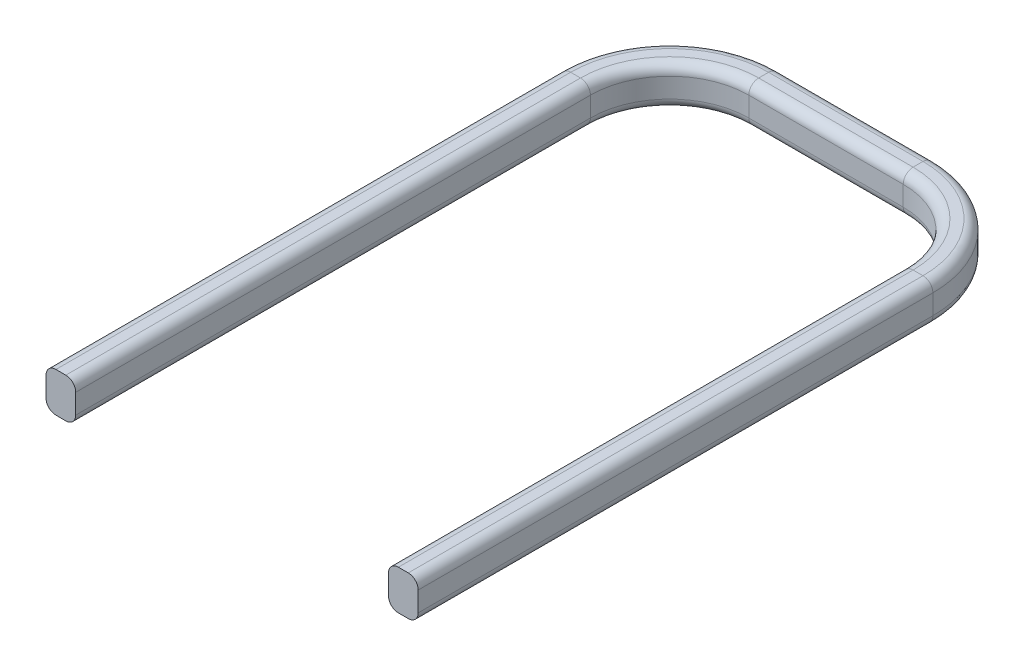
ISO-10303-21;
HEADER;
FILE_DESCRIPTION(('STEP AP214'),'2;1');
FILE_NAME('part.step','',(''),(''),'','','');
FILE_SCHEMA(('AUTOMOTIVE_DESIGN { 1 0 10303 214 1 1 1 1 }'));
ENDSEC;
DATA;
#1=APPLICATION_CONTEXT('core data for automotive mechanical design processes');
#2=APPLICATION_PROTOCOL_DEFINITION('international standard','automotive_design',2000,#1);
#3=PRODUCT_CONTEXT('',#1,'mechanical');
#4=PRODUCT('Part','Part','',(#3));
#5=PRODUCT_RELATED_PRODUCT_CATEGORY('part','',(#4));
#6=PRODUCT_DEFINITION_FORMATION('','',#4);
#7=PRODUCT_DEFINITION_CONTEXT('part definition',#1,'design');
#8=PRODUCT_DEFINITION('design','',#6,#7);
#9=PRODUCT_DEFINITION_SHAPE('','',#8);
#10=(LENGTH_UNIT() NAMED_UNIT(*) SI_UNIT(.MILLI.,.METRE.));
#11=(NAMED_UNIT(*) PLANE_ANGLE_UNIT() SI_UNIT($,.RADIAN.));
#12=(NAMED_UNIT(*) SI_UNIT($,.STERADIAN.) SOLID_ANGLE_UNIT());
#13=UNCERTAINTY_MEASURE_WITH_UNIT(LENGTH_MEASURE(1.E-05),#10,'distance_accuracy_value','');
#14=(GEOMETRIC_REPRESENTATION_CONTEXT(3) GLOBAL_UNCERTAINTY_ASSIGNED_CONTEXT((#13)) GLOBAL_UNIT_ASSIGNED_CONTEXT((#10,
#11,#12)) REPRESENTATION_CONTEXT('',''));
#15=CARTESIAN_POINT('',(0.,0.,0.));
#16=DIRECTION('',(0.,0.,1.));
#17=DIRECTION('',(1.,0.,0.));
#18=AXIS2_PLACEMENT_3D('',#15,#16,#17);
#19=CARTESIAN_POINT('',(0.,0.,0.));
#20=DIRECTION('',(0.,0.,-1.));
#21=DIRECTION('',(-1.,0.,0.));
#22=AXIS2_PLACEMENT_3D('',#19,#20,#21);
#23=PLANE('',#22);
#24=DIRECTION('',(0.,-1.,0.));
#25=VECTOR('',#24,1.);
#26=CARTESIAN_POINT('',(4.7,0.,0.));
#27=LINE('',#26,#25);
#28=CARTESIAN_POINT('',(4.7,0.75,0.));
#29=VERTEX_POINT('',#28);
#30=CARTESIAN_POINT('',(4.7,0.25,0.));
#31=VERTEX_POINT('',#30);
#32=EDGE_CURVE('E327',#29,#31,#27,.T.);
#33=ORIENTED_EDGE('',*,*,#32,.F.);
#34=CARTESIAN_POINT('',(4.45,0.75,0.));
#35=DIRECTION('',(0.,0.,-1.));
#36=DIRECTION('',(-1.,0.,0.));
#37=AXIS2_PLACEMENT_3D('',#34,#35,#36);
#38=CIRCLE('',#37,0.25);
#39=CARTESIAN_POINT('',(4.45,1.,0.));
#40=VERTEX_POINT('',#39);
#41=EDGE_CURVE('E209',#29,#40,#38,.F.);
#42=ORIENTED_EDGE('',*,*,#41,.T.);
#43=DIRECTION('',(1.,0.,0.));
#44=VECTOR('',#43,1.);
#45=CARTESIAN_POINT('',(3.95,1.,0.));
#46=LINE('',#45,#44);
#47=CARTESIAN_POINT('',(4.2,1.,0.));
#48=VERTEX_POINT('',#47);
#49=EDGE_CURVE('E323',#48,#40,#46,.T.);
#50=ORIENTED_EDGE('',*,*,#49,.F.);
#51=CARTESIAN_POINT('',(4.2,0.75,0.));
#52=DIRECTION('',(0.,0.,-1.));
#53=DIRECTION('',(-1.,0.,0.));
#54=AXIS2_PLACEMENT_3D('',#51,#52,#53);
#55=CIRCLE('',#54,0.25);
#56=CARTESIAN_POINT('',(3.95,0.75,0.));
#57=VERTEX_POINT('',#56);
#58=EDGE_CURVE('E229',#48,#57,#55,.F.);
#59=ORIENTED_EDGE('',*,*,#58,.T.);
#60=DIRECTION('',(0.,1.,0.));
#61=VECTOR('',#60,1.);
#62=CARTESIAN_POINT('',(3.95,0.,0.));
#63=LINE('',#62,#61);
#64=CARTESIAN_POINT('',(3.95,0.25,0.));
#65=VERTEX_POINT('',#64);
#66=EDGE_CURVE('E317',#65,#57,#63,.T.);
#67=ORIENTED_EDGE('',*,*,#66,.F.);
#68=CARTESIAN_POINT('',(4.2,0.25,0.));
#69=DIRECTION('',(0.,0.,-1.));
#70=DIRECTION('',(-1.,0.,0.));
#71=AXIS2_PLACEMENT_3D('',#68,#69,#70);
#72=CIRCLE('',#71,0.25);
#73=CARTESIAN_POINT('',(4.2,0.,0.));
#74=VERTEX_POINT('',#73);
#75=EDGE_CURVE('E391',#65,#74,#72,.F.);
#76=ORIENTED_EDGE('',*,*,#75,.T.);
#77=DIRECTION('',(-1.,0.,0.));
#78=VECTOR('',#77,1.);
#79=CARTESIAN_POINT('',(3.95,0.,0.));
#80=LINE('',#79,#78);
#81=CARTESIAN_POINT('',(4.45,0.,0.));
#82=VERTEX_POINT('',#81);
#83=EDGE_CURVE('E332',#82,#74,#80,.T.);
#84=ORIENTED_EDGE('',*,*,#83,.F.);
#85=CARTESIAN_POINT('',(4.45,0.25,0.));
#86=DIRECTION('',(0.,0.,-1.));
#87=DIRECTION('',(-1.,0.,0.));
#88=AXIS2_PLACEMENT_3D('',#85,#86,#87);
#89=CIRCLE('',#88,0.25);
#90=EDGE_CURVE('E393',#82,#31,#89,.F.);
#91=ORIENTED_EDGE('',*,*,#90,.T.);
#92=EDGE_LOOP('',(#33,#42,#50,#59,#67,#76,#84,#91));
#93=FACE_BOUND('',#92,.T.);
#94=ADVANCED_FACE('F33',(#93),#23,.F.);
#95=CARTESIAN_POINT('',(0.,0.,0.));
#96=DIRECTION('',(0.,0.,1.));
#97=DIRECTION('',(1.,0.,0.));
#98=AXIS2_PLACEMENT_3D('',#95,#96,#97);
#99=PLANE('',#98);
#100=DIRECTION('',(-1.,0.,0.));
#101=VECTOR('',#100,1.);
#102=CARTESIAN_POINT('',(-3.95,1.,0.));
#103=LINE('',#102,#101);
#104=CARTESIAN_POINT('',(-4.2,1.,0.));
#105=VERTEX_POINT('',#104);
#106=CARTESIAN_POINT('',(-4.45,1.,0.));
#107=VERTEX_POINT('',#106);
#108=EDGE_CURVE('E349',#105,#107,#103,.T.);
#109=ORIENTED_EDGE('',*,*,#108,.T.);
#110=CARTESIAN_POINT('',(-4.45,0.75,0.));
#111=DIRECTION('',(0.,0.,1.));
#112=DIRECTION('',(1.,0.,0.));
#113=AXIS2_PLACEMENT_3D('',#110,#111,#112);
#114=CIRCLE('',#113,0.25);
#115=CARTESIAN_POINT('',(-4.7,0.75,0.));
#116=VERTEX_POINT('',#115);
#117=EDGE_CURVE('E458',#107,#116,#114,.T.);
#118=ORIENTED_EDGE('',*,*,#117,.T.);
#119=DIRECTION('',(0.,-1.,0.));
#120=VECTOR('',#119,1.);
#121=CARTESIAN_POINT('',(-4.7,0.,0.));
#122=LINE('',#121,#120);
#123=CARTESIAN_POINT('',(-4.7,0.25,0.));
#124=VERTEX_POINT('',#123);
#125=EDGE_CURVE('E362',#116,#124,#122,.T.);
#126=ORIENTED_EDGE('',*,*,#125,.T.);
#127=CARTESIAN_POINT('',(-4.45,0.25,0.));
#128=DIRECTION('',(0.,0.,1.));
#129=DIRECTION('',(1.,0.,0.));
#130=AXIS2_PLACEMENT_3D('',#127,#128,#129);
#131=CIRCLE('',#130,0.25);
#132=CARTESIAN_POINT('',(-4.45,0.,0.));
#133=VERTEX_POINT('',#132);
#134=EDGE_CURVE('E57',#124,#133,#131,.T.);
#135=ORIENTED_EDGE('',*,*,#134,.T.);
#136=DIRECTION('',(1.,0.,0.));
#137=VECTOR('',#136,1.);
#138=CARTESIAN_POINT('',(-3.95,0.,0.));
#139=LINE('',#138,#137);
#140=CARTESIAN_POINT('',(-4.2,0.,0.));
#141=VERTEX_POINT('',#140);
#142=EDGE_CURVE('E230',#133,#141,#139,.T.);
#143=ORIENTED_EDGE('',*,*,#142,.T.);
#144=CARTESIAN_POINT('',(-4.2,0.25,0.));
#145=DIRECTION('',(0.,0.,1.));
#146=DIRECTION('',(1.,0.,0.));
#147=AXIS2_PLACEMENT_3D('',#144,#145,#146);
#148=CIRCLE('',#147,0.25);
#149=CARTESIAN_POINT('',(-3.95,0.25,0.));
#150=VERTEX_POINT('',#149);
#151=EDGE_CURVE('E455',#141,#150,#148,.T.);
#152=ORIENTED_EDGE('',*,*,#151,.T.);
#153=DIRECTION('',(0.,1.,0.));
#154=VECTOR('',#153,1.);
#155=CARTESIAN_POINT('',(-3.95,0.,0.));
#156=LINE('',#155,#154);
#157=CARTESIAN_POINT('',(-3.95,0.75,0.));
#158=VERTEX_POINT('',#157);
#159=EDGE_CURVE('E347',#150,#158,#156,.T.);
#160=ORIENTED_EDGE('',*,*,#159,.T.);
#161=CARTESIAN_POINT('',(-4.2,0.75,0.));
#162=DIRECTION('',(0.,0.,1.));
#163=DIRECTION('',(1.,0.,0.));
#164=AXIS2_PLACEMENT_3D('',#161,#162,#163);
#165=CIRCLE('',#164,0.25);
#166=EDGE_CURVE('E453',#158,#105,#165,.T.);
#167=ORIENTED_EDGE('',*,*,#166,.T.);
#168=EDGE_LOOP('',(#109,#118,#126,#135,#143,#152,#160,#167));
#169=FACE_BOUND('',#168,.T.);
#170=ADVANCED_FACE('F474',(#169),#99,.T.);
#171=CARTESIAN_POINT('',(3.95,0.,0.));
#172=DIRECTION('',(-1.,0.,0.));
#173=DIRECTION('',(0.,0.,1.));
#174=AXIS2_PLACEMENT_3D('',#171,#172,#173);
#175=PLANE('',#174);
#176=DIRECTION('',(0.,1.,0.));
#177=VECTOR('',#176,1.);
#178=CARTESIAN_POINT('',(3.95,0.,-13.));
#179=LINE('',#178,#177);
#180=CARTESIAN_POINT('',(3.95,0.25,-13.));
#181=VERTEX_POINT('',#180);
#182=CARTESIAN_POINT('',(3.95,0.75,-13.));
#183=VERTEX_POINT('',#182);
#184=EDGE_CURVE('E221',#181,#183,#179,.T.);
#185=ORIENTED_EDGE('',*,*,#184,.F.);
#186=DIRECTION('',(0.,0.,-1.));
#187=VECTOR('',#186,1.);
#188=CARTESIAN_POINT('',(3.95,0.25,0.));
#189=LINE('',#188,#187);
#190=EDGE_CURVE('E436',#181,#65,#189,.F.);
#191=ORIENTED_EDGE('',*,*,#190,.T.);
#192=ORIENTED_EDGE('',*,*,#66,.T.);
#193=DIRECTION('',(0.,0.,-1.));
#194=VECTOR('',#193,1.);
#195=CARTESIAN_POINT('',(3.95,0.75,0.));
#196=LINE('',#195,#194);
#197=EDGE_CURVE('E434',#57,#183,#196,.T.);
#198=ORIENTED_EDGE('',*,*,#197,.T.);
#199=EDGE_LOOP('',(#185,#191,#192,#198));
#200=FACE_BOUND('',#199,.T.);
#201=ADVANCED_FACE('F531',(#200),#175,.T.);
#202=CARTESIAN_POINT('',(3.95,1.,0.));
#203=DIRECTION('',(0.,1.,0.));
#204=DIRECTION('',(-1.,0.,0.));
#205=AXIS2_PLACEMENT_3D('',#202,#203,#204);
#206=PLANE('',#205);
#207=ORIENTED_EDGE('',*,*,#49,.T.);
#208=DIRECTION('',(0.,0.,-1.));
#209=VECTOR('',#208,1.);
#210=CARTESIAN_POINT('',(4.45,1.,0.));
#211=LINE('',#210,#209);
#212=CARTESIAN_POINT('',(4.45,1.,-13.));
#213=VERTEX_POINT('',#212);
#214=EDGE_CURVE('E219',#40,#213,#211,.T.);
#215=ORIENTED_EDGE('',*,*,#214,.T.);
#216=DIRECTION('',(1.,0.,0.));
#217=VECTOR('',#216,1.);
#218=CARTESIAN_POINT('',(3.95,1.,-13.));
#219=LINE('',#218,#217);
#220=CARTESIAN_POINT('',(4.2,1.,-13.));
#221=VERTEX_POINT('',#220);
#222=EDGE_CURVE('E201',#221,#213,#219,.T.);
#223=ORIENTED_EDGE('',*,*,#222,.F.);
#224=DIRECTION('',(0.,0.,-1.));
#225=VECTOR('',#224,1.);
#226=CARTESIAN_POINT('',(4.2,1.,0.));
#227=LINE('',#226,#225);
#228=EDGE_CURVE('E216',#221,#48,#227,.F.);
#229=ORIENTED_EDGE('',*,*,#228,.T.);
#230=EDGE_LOOP('',(#207,#215,#223,#229));
#231=FACE_BOUND('',#230,.T.);
#232=ADVANCED_FACE('F215',(#231),#206,.T.);
#233=CARTESIAN_POINT('',(4.7,0.,0.));
#234=DIRECTION('',(1.,0.,0.));
#235=DIRECTION('',(0.,0.,-1.));
#236=AXIS2_PLACEMENT_3D('',#233,#234,#235);
#237=PLANE('',#236);
#238=DIRECTION('',(0.,-1.,0.));
#239=VECTOR('',#238,1.);
#240=CARTESIAN_POINT('',(4.7,0.,-13.));
#241=LINE('',#240,#239);
#242=CARTESIAN_POINT('',(4.7,0.75,-13.));
#243=VERTEX_POINT('',#242);
#244=CARTESIAN_POINT('',(4.7,0.25,-13.));
#245=VERTEX_POINT('',#244);
#246=EDGE_CURVE('E220',#243,#245,#241,.T.);
#247=ORIENTED_EDGE('',*,*,#246,.F.);
#248=DIRECTION('',(0.,0.,-1.));
#249=VECTOR('',#248,1.);
#250=CARTESIAN_POINT('',(4.7,0.75,0.));
#251=LINE('',#250,#249);
#252=EDGE_CURVE('E388',#243,#29,#251,.F.);
#253=ORIENTED_EDGE('',*,*,#252,.T.);
#254=ORIENTED_EDGE('',*,*,#32,.T.);
#255=DIRECTION('',(0.,0.,-1.));
#256=VECTOR('',#255,1.);
#257=CARTESIAN_POINT('',(4.7,0.25,0.));
#258=LINE('',#257,#256);
#259=EDGE_CURVE('E385',#31,#245,#258,.T.);
#260=ORIENTED_EDGE('',*,*,#259,.T.);
#261=EDGE_LOOP('',(#247,#253,#254,#260));
#262=FACE_BOUND('',#261,.T.);
#263=ADVANCED_FACE('F501',(#262),#237,.T.);
#264=CARTESIAN_POINT('',(3.95,0.,0.));
#265=DIRECTION('',(0.,-1.,0.));
#266=DIRECTION('',(1.,0.,0.));
#267=AXIS2_PLACEMENT_3D('',#264,#265,#266);
#268=PLANE('',#267);
#269=DIRECTION('',(-1.,0.,0.));
#270=VECTOR('',#269,1.);
#271=CARTESIAN_POINT('',(3.95,0.,-13.));
#272=LINE('',#271,#270);
#273=CARTESIAN_POINT('',(4.45,0.,-13.));
#274=VERTEX_POINT('',#273);
#275=CARTESIAN_POINT('',(4.2,0.,-13.));
#276=VERTEX_POINT('',#275);
#277=EDGE_CURVE('E336',#274,#276,#272,.T.);
#278=ORIENTED_EDGE('',*,*,#277,.F.);
#279=DIRECTION('',(0.,0.,-1.));
#280=VECTOR('',#279,1.);
#281=CARTESIAN_POINT('',(4.45,0.,0.));
#282=LINE('',#281,#280);
#283=EDGE_CURVE('E420',#274,#82,#282,.F.);
#284=ORIENTED_EDGE('',*,*,#283,.T.);
#285=ORIENTED_EDGE('',*,*,#83,.T.);
#286=DIRECTION('',(0.,0.,-1.));
#287=VECTOR('',#286,1.);
#288=CARTESIAN_POINT('',(4.2,0.,0.));
#289=LINE('',#288,#287);
#290=EDGE_CURVE('E417',#74,#276,#289,.T.);
#291=ORIENTED_EDGE('',*,*,#290,.T.);
#292=EDGE_LOOP('',(#278,#284,#285,#291));
#293=FACE_BOUND('',#292,.T.);
#294=ADVANCED_FACE('F511',(#293),#268,.T.);
#295=CARTESIAN_POINT('',(1.95,0.,-13.));
#296=DIRECTION('',(0.,1.,0.));
#297=DIRECTION('',(0.,0.,1.));
#298=AXIS2_PLACEMENT_3D('',#295,#296,#297);
#299=CYLINDRICAL_SURFACE('',#298,2.);
#300=DIRECTION('',(0.,1.,0.));
#301=VECTOR('',#300,1.);
#302=CARTESIAN_POINT('',(1.95,0.,-15.));
#303=LINE('',#302,#301);
#304=CARTESIAN_POINT('',(1.95,0.25,-15.));
#305=VERTEX_POINT('',#304);
#306=CARTESIAN_POINT('',(1.95,0.75,-15.));
#307=VERTEX_POINT('',#306);
#308=EDGE_CURVE('E333',#305,#307,#303,.T.);
#309=ORIENTED_EDGE('',*,*,#308,.F.);
#310=CARTESIAN_POINT('',(1.95,0.25,-13.));
#311=DIRECTION('',(0.,-1.,0.));
#312=DIRECTION('',(0.,0.,-1.));
#313=AXIS2_PLACEMENT_3D('',#310,#311,#312);
#314=CIRCLE('',#313,2.);
#315=EDGE_CURVE('E439',#305,#181,#314,.T.);
#316=ORIENTED_EDGE('',*,*,#315,.T.);
#317=ORIENTED_EDGE('',*,*,#184,.T.);
#318=CARTESIAN_POINT('',(1.95,0.75,-13.));
#319=DIRECTION('',(0.,1.,0.));
#320=DIRECTION('',(0.,0.,1.));
#321=AXIS2_PLACEMENT_3D('',#318,#319,#320);
#322=CIRCLE('',#321,2.);
#323=EDGE_CURVE('E233',#183,#307,#322,.T.);
#324=ORIENTED_EDGE('',*,*,#323,.T.);
#325=EDGE_LOOP('',(#309,#316,#317,#324));
#326=FACE_BOUND('',#325,.T.);
#327=ADVANCED_FACE('F530',(#326),#299,.F.);
#328=CARTESIAN_POINT('',(3.95,1.,-13.));
#329=DIRECTION('',(0.,1.,0.));
#330=DIRECTION('',(0.,0.,1.));
#331=AXIS2_PLACEMENT_3D('',#328,#329,#330);
#332=PLANE('',#331);
#333=ORIENTED_EDGE('',*,*,#222,.T.);
#334=CARTESIAN_POINT('',(1.95,1.,-13.));
#335=DIRECTION('',(0.,1.,0.));
#336=DIRECTION('',(0.,0.,1.));
#337=AXIS2_PLACEMENT_3D('',#334,#335,#336);
#338=CIRCLE('',#337,2.5);
#339=CARTESIAN_POINT('',(1.95,1.,-15.5));
#340=VERTEX_POINT('',#339);
#341=EDGE_CURVE('E208',#213,#340,#338,.T.);
#342=ORIENTED_EDGE('',*,*,#341,.T.);
#343=DIRECTION('',(0.,0.,-1.));
#344=VECTOR('',#343,1.);
#345=CARTESIAN_POINT('',(1.95,1.,-15.));
#346=LINE('',#345,#344);
#347=CARTESIAN_POINT('',(1.95,1.,-15.25));
#348=VERTEX_POINT('',#347);
#349=EDGE_CURVE('E203',#348,#340,#346,.T.);
#350=ORIENTED_EDGE('',*,*,#349,.F.);
#351=CARTESIAN_POINT('',(1.95,1.,-13.));
#352=DIRECTION('',(0.,1.,0.));
#353=DIRECTION('',(0.,0.,1.));
#354=AXIS2_PLACEMENT_3D('',#351,#352,#353);
#355=CIRCLE('',#354,2.25);
#356=EDGE_CURVE('E198',#348,#221,#355,.F.);
#357=ORIENTED_EDGE('',*,*,#356,.T.);
#358=EDGE_LOOP('',(#333,#342,#350,#357));
#359=FACE_BOUND('',#358,.T.);
#360=ADVANCED_FACE('F200',(#359),#332,.T.);
#361=CARTESIAN_POINT('',(1.95,0.,-13.));
#362=DIRECTION('',(0.,1.,0.));
#363=DIRECTION('',(0.,0.,1.));
#364=AXIS2_PLACEMENT_3D('',#361,#362,#363);
#365=CYLINDRICAL_SURFACE('',#364,2.75);
#366=DIRECTION('',(0.,-1.,0.));
#367=VECTOR('',#366,1.);
#368=CARTESIAN_POINT('',(1.95,0.,-15.75));
#369=LINE('',#368,#367);
#370=CARTESIAN_POINT('',(1.95,0.75,-15.75));
#371=VERTEX_POINT('',#370);
#372=CARTESIAN_POINT('',(1.95,0.25,-15.75));
#373=VERTEX_POINT('',#372);
#374=EDGE_CURVE('E353',#371,#373,#369,.T.);
#375=ORIENTED_EDGE('',*,*,#374,.F.);
#376=CARTESIAN_POINT('',(1.95,0.75,-13.));
#377=DIRECTION('',(0.,1.,0.));
#378=DIRECTION('',(0.,0.,1.));
#379=AXIS2_PLACEMENT_3D('',#376,#377,#378);
#380=CIRCLE('',#379,2.75);
#381=EDGE_CURVE('E399',#371,#243,#380,.F.);
#382=ORIENTED_EDGE('',*,*,#381,.T.);
#383=ORIENTED_EDGE('',*,*,#246,.T.);
#384=CARTESIAN_POINT('',(1.95,0.25,-13.));
#385=DIRECTION('',(0.,-1.,0.));
#386=DIRECTION('',(0.,0.,-1.));
#387=AXIS2_PLACEMENT_3D('',#384,#385,#386);
#388=CIRCLE('',#387,2.75);
#389=EDGE_CURVE('E397',#245,#373,#388,.F.);
#390=ORIENTED_EDGE('',*,*,#389,.T.);
#391=EDGE_LOOP('',(#375,#382,#383,#390));
#392=FACE_BOUND('',#391,.T.);
#393=ADVANCED_FACE('F494',(#392),#365,.T.);
#394=CARTESIAN_POINT('',(3.95,0.,-13.));
#395=DIRECTION('',(0.,-1.,0.));
#396=DIRECTION('',(0.,0.,-1.));
#397=AXIS2_PLACEMENT_3D('',#394,#395,#396);
#398=PLANE('',#397);
#399=DIRECTION('',(0.,0.,1.));
#400=VECTOR('',#399,1.);
#401=CARTESIAN_POINT('',(1.95,0.,-15.));
#402=LINE('',#401,#400);
#403=CARTESIAN_POINT('',(1.95,0.,-15.5));
#404=VERTEX_POINT('',#403);
#405=CARTESIAN_POINT('',(1.95,0.,-15.25));
#406=VERTEX_POINT('',#405);
#407=EDGE_CURVE('E341',#404,#406,#402,.T.);
#408=ORIENTED_EDGE('',*,*,#407,.F.);
#409=CARTESIAN_POINT('',(1.95,0.,-13.));
#410=DIRECTION('',(0.,-1.,0.));
#411=DIRECTION('',(0.,0.,-1.));
#412=AXIS2_PLACEMENT_3D('',#409,#410,#411);
#413=CIRCLE('',#412,2.5);
#414=EDGE_CURVE('E424',#404,#274,#413,.T.);
#415=ORIENTED_EDGE('',*,*,#414,.T.);
#416=ORIENTED_EDGE('',*,*,#277,.T.);
#417=CARTESIAN_POINT('',(1.95,0.,-13.));
#418=DIRECTION('',(0.,-1.,0.));
#419=DIRECTION('',(0.,0.,-1.));
#420=AXIS2_PLACEMENT_3D('',#417,#418,#419);
#421=CIRCLE('',#420,2.25);
#422=EDGE_CURVE('E422',#276,#406,#421,.F.);
#423=ORIENTED_EDGE('',*,*,#422,.T.);
#424=EDGE_LOOP('',(#408,#415,#416,#423));
#425=FACE_BOUND('',#424,.T.);
#426=ADVANCED_FACE('F520',(#425),#398,.T.);
#427=CARTESIAN_POINT('',(1.94999999999999,0.,-15.));
#428=DIRECTION('',(0.,0.,1.));
#429=DIRECTION('',(1.,0.,0.));
#430=AXIS2_PLACEMENT_3D('',#427,#428,#429);
#431=PLANE('',#430);
#432=DIRECTION('',(0.,1.,0.));
#433=VECTOR('',#432,1.);
#434=CARTESIAN_POINT('',(-1.94999999999999,0.,-15.));
#435=LINE('',#434,#433);
#436=CARTESIAN_POINT('',(-1.94999999999999,0.25,-15.));
#437=VERTEX_POINT('',#436);
#438=CARTESIAN_POINT('',(-1.94999999999999,0.75,-15.));
#439=VERTEX_POINT('',#438);
#440=EDGE_CURVE('E337',#437,#439,#435,.T.);
#441=ORIENTED_EDGE('',*,*,#440,.F.);
#442=DIRECTION('',(-1.,0.,0.));
#443=VECTOR('',#442,1.);
#444=CARTESIAN_POINT('',(1.94999999999999,0.25,-15.));
#445=LINE('',#444,#443);
#446=EDGE_CURVE('E443',#437,#305,#445,.F.);
#447=ORIENTED_EDGE('',*,*,#446,.T.);
#448=ORIENTED_EDGE('',*,*,#308,.T.);
#449=DIRECTION('',(-1.,0.,0.));
#450=VECTOR('',#449,1.);
#451=CARTESIAN_POINT('',(1.94999999999999,0.75,-15.));
#452=LINE('',#451,#450);
#453=EDGE_CURVE('E441',#307,#439,#452,.T.);
#454=ORIENTED_EDGE('',*,*,#453,.T.);
#455=EDGE_LOOP('',(#441,#447,#448,#454));
#456=FACE_BOUND('',#455,.T.);
#457=ADVANCED_FACE('F528',(#456),#431,.T.);
#458=CARTESIAN_POINT('',(1.94999999999999,1.,-15.));
#459=DIRECTION('',(0.,1.,0.));
#460=DIRECTION('',(0.,0.,1.));
#461=AXIS2_PLACEMENT_3D('',#458,#459,#460);
#462=PLANE('',#461);
#463=ORIENTED_EDGE('',*,*,#349,.T.);
#464=DIRECTION('',(-1.,0.,0.));
#465=VECTOR('',#464,1.);
#466=CARTESIAN_POINT('',(1.94999999999999,1.,-15.5));
#467=LINE('',#466,#465);
#468=CARTESIAN_POINT('',(-1.94999999999999,1.,-15.5));
#469=VERTEX_POINT('',#468);
#470=EDGE_CURVE('E403',#340,#469,#467,.T.);
#471=ORIENTED_EDGE('',*,*,#470,.T.);
#472=DIRECTION('',(0.,0.,-1.));
#473=VECTOR('',#472,1.);
#474=CARTESIAN_POINT('',(-1.94999999999999,1.,-15.));
#475=LINE('',#474,#473);
#476=CARTESIAN_POINT('',(-1.94999999999999,1.,-15.25));
#477=VERTEX_POINT('',#476);
#478=EDGE_CURVE('E340',#477,#469,#475,.T.);
#479=ORIENTED_EDGE('',*,*,#478,.F.);
#480=DIRECTION('',(-1.,0.,0.));
#481=VECTOR('',#480,1.);
#482=CARTESIAN_POINT('',(1.94999999999999,1.,-15.25));
#483=LINE('',#482,#481);
#484=EDGE_CURVE('E401',#477,#348,#483,.F.);
#485=ORIENTED_EDGE('',*,*,#484,.T.);
#486=EDGE_LOOP('',(#463,#471,#479,#485));
#487=FACE_BOUND('',#486,.T.);
#488=ADVANCED_FACE('F749',(#487),#462,.T.);
#489=CARTESIAN_POINT('',(1.94999999999999,0.,-15.75));
#490=DIRECTION('',(0.,0.,-1.));
#491=DIRECTION('',(-1.,0.,0.));
#492=AXIS2_PLACEMENT_3D('',#489,#490,#491);
#493=PLANE('',#492);
#494=DIRECTION('',(0.,-1.,0.));
#495=VECTOR('',#494,1.);
#496=CARTESIAN_POINT('',(-1.94999999999999,0.,-15.75));
#497=LINE('',#496,#495);
#498=CARTESIAN_POINT('',(-1.94999999999999,0.75,-15.75));
#499=VERTEX_POINT('',#498);
#500=CARTESIAN_POINT('',(-1.94999999999999,0.25,-15.75));
#501=VERTEX_POINT('',#500);
#502=EDGE_CURVE('E356',#499,#501,#497,.T.);
#503=ORIENTED_EDGE('',*,*,#502,.F.);
#504=DIRECTION('',(-1.,0.,0.));
#505=VECTOR('',#504,1.);
#506=CARTESIAN_POINT('',(1.94999999999999,0.75,-15.75));
#507=LINE('',#506,#505);
#508=EDGE_CURVE('E407',#499,#371,#507,.F.);
#509=ORIENTED_EDGE('',*,*,#508,.T.);
#510=ORIENTED_EDGE('',*,*,#374,.T.);
#511=DIRECTION('',(-1.,0.,0.));
#512=VECTOR('',#511,1.);
#513=CARTESIAN_POINT('',(1.94999999999999,0.25,-15.75));
#514=LINE('',#513,#512);
#515=EDGE_CURVE('E405',#373,#501,#514,.T.);
#516=ORIENTED_EDGE('',*,*,#515,.T.);
#517=EDGE_LOOP('',(#503,#509,#510,#516));
#518=FACE_BOUND('',#517,.T.);
#519=ADVANCED_FACE('F492',(#518),#493,.T.);
#520=CARTESIAN_POINT('',(1.94999999999999,0.,-15.));
#521=DIRECTION('',(0.,-1.,0.));
#522=DIRECTION('',(0.,0.,-1.));
#523=AXIS2_PLACEMENT_3D('',#520,#521,#522);
#524=PLANE('',#523);
#525=DIRECTION('',(0.,0.,1.));
#526=VECTOR('',#525,1.);
#527=CARTESIAN_POINT('',(-1.94999999999999,0.,-15.));
#528=LINE('',#527,#526);
#529=CARTESIAN_POINT('',(-1.94999999999999,0.,-15.5));
#530=VERTEX_POINT('',#529);
#531=CARTESIAN_POINT('',(-1.94999999999999,0.,-15.25));
#532=VERTEX_POINT('',#531);
#533=EDGE_CURVE('E346',#530,#532,#528,.T.);
#534=ORIENTED_EDGE('',*,*,#533,.F.);
#535=DIRECTION('',(-1.,0.,0.));
#536=VECTOR('',#535,1.);
#537=CARTESIAN_POINT('',(1.94999999999999,0.,-15.5));
#538=LINE('',#537,#536);
#539=EDGE_CURVE('E428',#530,#404,#538,.F.);
#540=ORIENTED_EDGE('',*,*,#539,.T.);
#541=ORIENTED_EDGE('',*,*,#407,.T.);
#542=DIRECTION('',(-1.,0.,0.));
#543=VECTOR('',#542,1.);
#544=CARTESIAN_POINT('',(1.94999999999999,0.,-15.25));
#545=LINE('',#544,#543);
#546=EDGE_CURVE('E426',#406,#532,#545,.T.);
#547=ORIENTED_EDGE('',*,*,#546,.T.);
#548=EDGE_LOOP('',(#534,#540,#541,#547));
#549=FACE_BOUND('',#548,.T.);
#550=ADVANCED_FACE('F523',(#549),#524,.T.);
#551=CARTESIAN_POINT('',(-1.95,0.,-13.));
#552=DIRECTION('',(0.,1.,0.));
#553=DIRECTION('',(0.,0.,1.));
#554=AXIS2_PLACEMENT_3D('',#551,#552,#553);
#555=CYLINDRICAL_SURFACE('',#554,2.);
#556=DIRECTION('',(0.,1.,0.));
#557=VECTOR('',#556,1.);
#558=CARTESIAN_POINT('',(-3.95,0.,-13.));
#559=LINE('',#558,#557);
#560=CARTESIAN_POINT('',(-3.95,0.25,-13.));
#561=VERTEX_POINT('',#560);
#562=CARTESIAN_POINT('',(-3.95,0.75,-13.));
#563=VERTEX_POINT('',#562);
#564=EDGE_CURVE('E342',#561,#563,#559,.T.);
#565=ORIENTED_EDGE('',*,*,#564,.F.);
#566=CARTESIAN_POINT('',(-1.95,0.25,-13.));
#567=DIRECTION('',(0.,-1.,0.));
#568=DIRECTION('',(0.,0.,-1.));
#569=AXIS2_PLACEMENT_3D('',#566,#567,#568);
#570=CIRCLE('',#569,2.);
#571=EDGE_CURVE('E447',#561,#437,#570,.T.);
#572=ORIENTED_EDGE('',*,*,#571,.T.);
#573=ORIENTED_EDGE('',*,*,#440,.T.);
#574=CARTESIAN_POINT('',(-1.95,0.75,-13.));
#575=DIRECTION('',(0.,1.,0.));
#576=DIRECTION('',(0.,0.,1.));
#577=AXIS2_PLACEMENT_3D('',#574,#575,#576);
#578=CIRCLE('',#577,2.);
#579=EDGE_CURVE('E445',#439,#563,#578,.T.);
#580=ORIENTED_EDGE('',*,*,#579,.T.);
#581=EDGE_LOOP('',(#565,#572,#573,#580));
#582=FACE_BOUND('',#581,.T.);
#583=ADVANCED_FACE('F724',(#582),#555,.F.);
#584=CARTESIAN_POINT('',(-1.94999999999999,1.,-15.));
#585=DIRECTION('',(0.,1.,0.));
#586=DIRECTION('',(0.,0.,1.));
#587=AXIS2_PLACEMENT_3D('',#584,#585,#586);
#588=PLANE('',#587);
#589=ORIENTED_EDGE('',*,*,#478,.T.);
#590=CARTESIAN_POINT('',(-1.95,1.,-13.));
#591=DIRECTION('',(0.,1.,0.));
#592=DIRECTION('',(0.,0.,1.));
#593=AXIS2_PLACEMENT_3D('',#590,#591,#592);
#594=CIRCLE('',#593,2.5);
#595=CARTESIAN_POINT('',(-4.45,1.,-13.));
#596=VERTEX_POINT('',#595);
#597=EDGE_CURVE('E411',#469,#596,#594,.T.);
#598=ORIENTED_EDGE('',*,*,#597,.T.);
#599=DIRECTION('',(-1.,0.,0.));
#600=VECTOR('',#599,1.);
#601=CARTESIAN_POINT('',(-3.95,1.,-13.));
#602=LINE('',#601,#600);
#603=CARTESIAN_POINT('',(-4.2,1.,-13.));
#604=VERTEX_POINT('',#603);
#605=EDGE_CURVE('E345',#604,#596,#602,.T.);
#606=ORIENTED_EDGE('',*,*,#605,.F.);
#607=CARTESIAN_POINT('',(-1.95,1.,-13.));
#608=DIRECTION('',(0.,1.,0.));
#609=DIRECTION('',(0.,0.,1.));
#610=AXIS2_PLACEMENT_3D('',#607,#608,#609);
#611=CIRCLE('',#610,2.25);
#612=EDGE_CURVE('E409',#604,#477,#611,.F.);
#613=ORIENTED_EDGE('',*,*,#612,.T.);
#614=EDGE_LOOP('',(#589,#598,#606,#613));
#615=FACE_BOUND('',#614,.T.);
#616=ADVANCED_FACE('F483',(#615),#588,.T.);
#617=CARTESIAN_POINT('',(-1.95,0.,-13.));
#618=DIRECTION('',(0.,1.,0.));
#619=DIRECTION('',(0.,0.,1.));
#620=AXIS2_PLACEMENT_3D('',#617,#618,#619);
#621=CYLINDRICAL_SURFACE('',#620,2.75);
#622=DIRECTION('',(0.,-1.,0.));
#623=VECTOR('',#622,1.);
#624=CARTESIAN_POINT('',(-4.7,0.,-13.));
#625=LINE('',#624,#623);
#626=CARTESIAN_POINT('',(-4.7,0.75,-13.));
#627=VERTEX_POINT('',#626);
#628=CARTESIAN_POINT('',(-4.7,0.25,-13.));
#629=VERTEX_POINT('',#628);
#630=EDGE_CURVE('E359',#627,#629,#625,.T.);
#631=ORIENTED_EDGE('',*,*,#630,.F.);
#632=CARTESIAN_POINT('',(-1.95,0.75,-13.));
#633=DIRECTION('',(0.,1.,0.));
#634=DIRECTION('',(0.,0.,1.));
#635=AXIS2_PLACEMENT_3D('',#632,#633,#634);
#636=CIRCLE('',#635,2.75);
#637=EDGE_CURVE('E415',#627,#499,#636,.F.);
#638=ORIENTED_EDGE('',*,*,#637,.T.);
#639=ORIENTED_EDGE('',*,*,#502,.T.);
#640=CARTESIAN_POINT('',(-1.95,0.25,-13.));
#641=DIRECTION('',(0.,-1.,0.));
#642=DIRECTION('',(0.,0.,-1.));
#643=AXIS2_PLACEMENT_3D('',#640,#641,#642);
#644=CIRCLE('',#643,2.75);
#645=EDGE_CURVE('E413',#501,#629,#644,.F.);
#646=ORIENTED_EDGE('',*,*,#645,.T.);
#647=EDGE_LOOP('',(#631,#638,#639,#646));
#648=FACE_BOUND('',#647,.T.);
#649=ADVANCED_FACE('F706',(#648),#621,.T.);
#650=CARTESIAN_POINT('',(-1.94999999999999,0.,-15.));
#651=DIRECTION('',(0.,-1.,0.));
#652=DIRECTION('',(0.,0.,-1.));
#653=AXIS2_PLACEMENT_3D('',#650,#651,#652);
#654=PLANE('',#653);
#655=DIRECTION('',(1.,0.,0.));
#656=VECTOR('',#655,1.);
#657=CARTESIAN_POINT('',(-3.95,0.,-13.));
#658=LINE('',#657,#656);
#659=CARTESIAN_POINT('',(-4.45,0.,-13.));
#660=VERTEX_POINT('',#659);
#661=CARTESIAN_POINT('',(-4.2,0.,-13.));
#662=VERTEX_POINT('',#661);
#663=EDGE_CURVE('E350',#660,#662,#658,.T.);
#664=ORIENTED_EDGE('',*,*,#663,.F.);
#665=CARTESIAN_POINT('',(-1.95,0.,-13.));
#666=DIRECTION('',(0.,-1.,0.));
#667=DIRECTION('',(0.,0.,-1.));
#668=AXIS2_PLACEMENT_3D('',#665,#666,#667);
#669=CIRCLE('',#668,2.5);
#670=EDGE_CURVE('E432',#660,#530,#669,.T.);
#671=ORIENTED_EDGE('',*,*,#670,.T.);
#672=ORIENTED_EDGE('',*,*,#533,.T.);
#673=CARTESIAN_POINT('',(-1.95,0.,-13.));
#674=DIRECTION('',(0.,-1.,0.));
#675=DIRECTION('',(0.,0.,-1.));
#676=AXIS2_PLACEMENT_3D('',#673,#674,#675);
#677=CIRCLE('',#676,2.25);
#678=EDGE_CURVE('E430',#532,#662,#677,.F.);
#679=ORIENTED_EDGE('',*,*,#678,.T.);
#680=EDGE_LOOP('',(#664,#671,#672,#679));
#681=FACE_BOUND('',#680,.T.);
#682=ADVANCED_FACE('F555',(#681),#654,.T.);
#683=CARTESIAN_POINT('',(-3.95,0.,-13.));
#684=DIRECTION('',(1.,0.,0.));
#685=DIRECTION('',(0.,0.,-1.));
#686=AXIS2_PLACEMENT_3D('',#683,#684,#685);
#687=PLANE('',#686);
#688=ORIENTED_EDGE('',*,*,#159,.F.);
#689=DIRECTION('',(0.,0.,1.));
#690=VECTOR('',#689,1.);
#691=CARTESIAN_POINT('',(-3.95,0.25,-13.));
#692=LINE('',#691,#690);
#693=EDGE_CURVE('E11',#150,#561,#692,.F.);
#694=ORIENTED_EDGE('',*,*,#693,.T.);
#695=ORIENTED_EDGE('',*,*,#564,.T.);
#696=DIRECTION('',(0.,0.,1.));
#697=VECTOR('',#696,1.);
#698=CARTESIAN_POINT('',(-3.95,0.75,-13.));
#699=LINE('',#698,#697);
#700=EDGE_CURVE('E42',#563,#158,#699,.T.);
#701=ORIENTED_EDGE('',*,*,#700,.T.);
#702=EDGE_LOOP('',(#688,#694,#695,#701));
#703=FACE_BOUND('',#702,.T.);
#704=ADVANCED_FACE('F469',(#703),#687,.T.);
#705=CARTESIAN_POINT('',(-3.95,1.,-13.));
#706=DIRECTION('',(0.,1.,0.));
#707=DIRECTION('',(-1.,0.,0.));
#708=AXIS2_PLACEMENT_3D('',#705,#706,#707);
#709=PLANE('',#708);
#710=ORIENTED_EDGE('',*,*,#605,.T.);
#711=DIRECTION('',(0.,0.,1.));
#712=VECTOR('',#711,1.);
#713=CARTESIAN_POINT('',(-4.45,1.,-13.));
#714=LINE('',#713,#712);
#715=EDGE_CURVE('E451',#596,#107,#714,.T.);
#716=ORIENTED_EDGE('',*,*,#715,.T.);
#717=ORIENTED_EDGE('',*,*,#108,.F.);
#718=DIRECTION('',(0.,0.,1.));
#719=VECTOR('',#718,1.);
#720=CARTESIAN_POINT('',(-4.2,1.,-13.));
#721=LINE('',#720,#719);
#722=EDGE_CURVE('E449',#105,#604,#721,.F.);
#723=ORIENTED_EDGE('',*,*,#722,.T.);
#724=EDGE_LOOP('',(#710,#716,#717,#723));
#725=FACE_BOUND('',#724,.T.);
#726=ADVANCED_FACE('F480',(#725),#709,.T.);
#727=CARTESIAN_POINT('',(-4.7,0.,-13.));
#728=DIRECTION('',(-1.,0.,0.));
#729=DIRECTION('',(0.,0.,1.));
#730=AXIS2_PLACEMENT_3D('',#727,#728,#729);
#731=PLANE('',#730);
#732=ORIENTED_EDGE('',*,*,#125,.F.);
#733=DIRECTION('',(0.,0.,1.));
#734=VECTOR('',#733,1.);
#735=CARTESIAN_POINT('',(-4.7,0.75,-13.));
#736=LINE('',#735,#734);
#737=EDGE_CURVE('E462',#116,#627,#736,.F.);
#738=ORIENTED_EDGE('',*,*,#737,.T.);
#739=ORIENTED_EDGE('',*,*,#630,.T.);
#740=DIRECTION('',(0.,0.,1.));
#741=VECTOR('',#740,1.);
#742=CARTESIAN_POINT('',(-4.7,0.25,-13.));
#743=LINE('',#742,#741);
#744=EDGE_CURVE('E460',#629,#124,#743,.T.);
#745=ORIENTED_EDGE('',*,*,#744,.T.);
#746=EDGE_LOOP('',(#732,#738,#739,#745));
#747=FACE_BOUND('',#746,.T.);
#748=ADVANCED_FACE('F544',(#747),#731,.T.);
#749=CARTESIAN_POINT('',(-3.95,0.,-13.));
#750=DIRECTION('',(0.,-1.,0.));
#751=DIRECTION('',(1.,0.,0.));
#752=AXIS2_PLACEMENT_3D('',#749,#750,#751);
#753=PLANE('',#752);
#754=ORIENTED_EDGE('',*,*,#142,.F.);
#755=DIRECTION('',(0.,0.,1.));
#756=VECTOR('',#755,1.);
#757=CARTESIAN_POINT('',(-4.45,0.,-13.));
#758=LINE('',#757,#756);
#759=EDGE_CURVE('E465',#133,#660,#758,.F.);
#760=ORIENTED_EDGE('',*,*,#759,.T.);
#761=ORIENTED_EDGE('',*,*,#663,.T.);
#762=DIRECTION('',(0.,0.,1.));
#763=VECTOR('',#762,1.);
#764=CARTESIAN_POINT('',(-4.2,0.,-13.));
#765=LINE('',#764,#763);
#766=EDGE_CURVE('E50',#662,#141,#765,.T.);
#767=ORIENTED_EDGE('',*,*,#766,.T.);
#768=EDGE_LOOP('',(#754,#760,#761,#767));
#769=FACE_BOUND('',#768,.T.);
#770=ADVANCED_FACE('F541',(#769),#753,.T.);
#771=CARTESIAN_POINT('',(-4.45,0.75,-13.));
#772=DIRECTION('',(0.,0.,1.));
#773=DIRECTION('',(1.,0.,0.));
#774=AXIS2_PLACEMENT_3D('',#771,#772,#773);
#775=CYLINDRICAL_SURFACE('',#774,0.25);
#776=ORIENTED_EDGE('',*,*,#117,.F.);
#777=ORIENTED_EDGE('',*,*,#715,.F.);
#778=CARTESIAN_POINT('',(-4.45,0.75,-13.));
#779=DIRECTION('',(0.,0.,-1.));
#780=DIRECTION('',(-1.,0.,0.));
#781=AXIS2_PLACEMENT_3D('',#778,#779,#780);
#782=CIRCLE('',#781,0.25);
#783=EDGE_CURVE('E288',#627,#596,#782,.T.);
#784=ORIENTED_EDGE('',*,*,#783,.F.);
#785=ORIENTED_EDGE('',*,*,#737,.F.);
#786=EDGE_LOOP('',(#776,#777,#784,#785));
#787=FACE_BOUND('',#786,.T.);
#788=ADVANCED_FACE('F543',(#787),#775,.T.);
#789=CARTESIAN_POINT('',(-1.95,0.75,-13.));
#790=DIRECTION('',(0.,1.,0.));
#791=DIRECTION('',(0.,0.,1.));
#792=AXIS2_PLACEMENT_3D('',#789,#790,#791);
#793=TOROIDAL_SURFACE('',#792,2.5,0.25);
#794=ORIENTED_EDGE('',*,*,#783,.T.);
#795=ORIENTED_EDGE('',*,*,#597,.F.);
#796=CARTESIAN_POINT('',(-1.94999999999999,0.75,-15.5));
#797=DIRECTION('',(1.,0.,0.));
#798=DIRECTION('',(0.,1.,0.));
#799=AXIS2_PLACEMENT_3D('',#796,#797,#798);
#800=CIRCLE('',#799,0.25);
#801=EDGE_CURVE('E308',#499,#469,#800,.T.);
#802=ORIENTED_EDGE('',*,*,#801,.F.);
#803=ORIENTED_EDGE('',*,*,#637,.F.);
#804=EDGE_LOOP('',(#794,#795,#802,#803));
#805=FACE_BOUND('',#804,.T.);
#806=ADVANCED_FACE('F485',(#805),#793,.T.);
#807=CARTESIAN_POINT('',(1.94999999999999,0.75,-15.5));
#808=DIRECTION('',(-1.,0.,0.));
#809=DIRECTION('',(0.,0.,1.));
#810=AXIS2_PLACEMENT_3D('',#807,#808,#809);
#811=CYLINDRICAL_SURFACE('',#810,0.25);
#812=ORIENTED_EDGE('',*,*,#801,.T.);
#813=ORIENTED_EDGE('',*,*,#470,.F.);
#814=CARTESIAN_POINT('',(1.95,0.75,-15.5));
#815=DIRECTION('',(1.,0.,0.));
#816=DIRECTION('',(0.,0.,-1.));
#817=AXIS2_PLACEMENT_3D('',#814,#815,#816);
#818=CIRCLE('',#817,0.25);
#819=EDGE_CURVE('E301',#371,#340,#818,.T.);
#820=ORIENTED_EDGE('',*,*,#819,.F.);
#821=ORIENTED_EDGE('',*,*,#508,.F.);
#822=EDGE_LOOP('',(#812,#813,#820,#821));
#823=FACE_BOUND('',#822,.T.);
#824=ADVANCED_FACE('F487',(#823),#811,.T.);
#825=CARTESIAN_POINT('',(1.95,0.75,-13.));
#826=DIRECTION('',(0.,1.,0.));
#827=DIRECTION('',(0.,0.,1.));
#828=AXIS2_PLACEMENT_3D('',#825,#826,#827);
#829=TOROIDAL_SURFACE('',#828,2.5,0.25);
#830=ORIENTED_EDGE('',*,*,#819,.T.);
#831=ORIENTED_EDGE('',*,*,#341,.F.);
#832=CARTESIAN_POINT('',(4.45,0.75,-13.));
#833=DIRECTION('',(0.,0.,1.));
#834=DIRECTION('',(0.,-1.,0.));
#835=AXIS2_PLACEMENT_3D('',#832,#833,#834);
#836=CIRCLE('',#835,0.25);
#837=EDGE_CURVE('E296',#243,#213,#836,.T.);
#838=ORIENTED_EDGE('',*,*,#837,.F.);
#839=ORIENTED_EDGE('',*,*,#381,.F.);
#840=EDGE_LOOP('',(#830,#831,#838,#839));
#841=FACE_BOUND('',#840,.T.);
#842=ADVANCED_FACE('F564',(#841),#829,.T.);
#843=CARTESIAN_POINT('',(4.45,0.75,0.));
#844=DIRECTION('',(0.,0.,-1.));
#845=DIRECTION('',(-1.,0.,0.));
#846=AXIS2_PLACEMENT_3D('',#843,#844,#845);
#847=CYLINDRICAL_SURFACE('',#846,0.25);
#848=ORIENTED_EDGE('',*,*,#41,.F.);
#849=ORIENTED_EDGE('',*,*,#252,.F.);
#850=ORIENTED_EDGE('',*,*,#837,.T.);
#851=ORIENTED_EDGE('',*,*,#214,.F.);
#852=EDGE_LOOP('',(#848,#849,#850,#851));
#853=FACE_BOUND('',#852,.T.);
#854=ADVANCED_FACE('F560',(#853),#847,.T.);
#855=CARTESIAN_POINT('',(-4.45,0.25,-13.));
#856=DIRECTION('',(0.,0.,1.));
#857=DIRECTION('',(1.,0.,0.));
#858=AXIS2_PLACEMENT_3D('',#855,#856,#857);
#859=CYLINDRICAL_SURFACE('',#858,0.25);
#860=ORIENTED_EDGE('',*,*,#134,.F.);
#861=ORIENTED_EDGE('',*,*,#744,.F.);
#862=CARTESIAN_POINT('',(-4.45,0.25,-13.));
#863=DIRECTION('',(0.,0.,-1.));
#864=DIRECTION('',(-1.,0.,0.));
#865=AXIS2_PLACEMENT_3D('',#862,#863,#864);
#866=CIRCLE('',#865,0.25);
#867=EDGE_CURVE('E264',#660,#629,#866,.T.);
#868=ORIENTED_EDGE('',*,*,#867,.F.);
#869=ORIENTED_EDGE('',*,*,#759,.F.);
#870=EDGE_LOOP('',(#860,#861,#868,#869));
#871=FACE_BOUND('',#870,.T.);
#872=ADVANCED_FACE('F563',(#871),#859,.T.);
#873=CARTESIAN_POINT('',(-1.95,0.25,-13.));
#874=DIRECTION('',(0.,-1.,0.));
#875=DIRECTION('',(0.,0.,-1.));
#876=AXIS2_PLACEMENT_3D('',#873,#874,#875);
#877=TOROIDAL_SURFACE('',#876,2.5,0.25);
#878=ORIENTED_EDGE('',*,*,#867,.T.);
#879=ORIENTED_EDGE('',*,*,#645,.F.);
#880=CARTESIAN_POINT('',(-1.94999999999999,0.25,-15.5));
#881=DIRECTION('',(1.,0.,0.));
#882=DIRECTION('',(0.,0.,-1.));
#883=AXIS2_PLACEMENT_3D('',#880,#881,#882);
#884=CIRCLE('',#883,0.25);
#885=EDGE_CURVE('E285',#530,#501,#884,.T.);
#886=ORIENTED_EDGE('',*,*,#885,.F.);
#887=ORIENTED_EDGE('',*,*,#670,.F.);
#888=EDGE_LOOP('',(#878,#879,#886,#887));
#889=FACE_BOUND('',#888,.T.);
#890=ADVANCED_FACE('F580',(#889),#877,.T.);
#891=CARTESIAN_POINT('',(1.94999999999999,0.25,-15.5));
#892=DIRECTION('',(-1.,0.,0.));
#893=DIRECTION('',(0.,0.,1.));
#894=AXIS2_PLACEMENT_3D('',#891,#892,#893);
#895=CYLINDRICAL_SURFACE('',#894,0.25);
#896=ORIENTED_EDGE('',*,*,#885,.T.);
#897=ORIENTED_EDGE('',*,*,#515,.F.);
#898=CARTESIAN_POINT('',(1.95,0.25,-15.5));
#899=DIRECTION('',(1.,0.,0.));
#900=DIRECTION('',(0.,0.,-1.));
#901=AXIS2_PLACEMENT_3D('',#898,#899,#900);
#902=CIRCLE('',#901,0.25);
#903=EDGE_CURVE('E277',#404,#373,#902,.T.);
#904=ORIENTED_EDGE('',*,*,#903,.F.);
#905=ORIENTED_EDGE('',*,*,#539,.F.);
#906=EDGE_LOOP('',(#896,#897,#904,#905));
#907=FACE_BOUND('',#906,.T.);
#908=ADVANCED_FACE('F577',(#907),#895,.T.);
#909=CARTESIAN_POINT('',(1.95,0.25,-13.));
#910=DIRECTION('',(0.,-1.,0.));
#911=DIRECTION('',(0.,0.,-1.));
#912=AXIS2_PLACEMENT_3D('',#909,#910,#911);
#913=TOROIDAL_SURFACE('',#912,2.5,0.25);
#914=ORIENTED_EDGE('',*,*,#903,.T.);
#915=ORIENTED_EDGE('',*,*,#389,.F.);
#916=CARTESIAN_POINT('',(4.45,0.25,-13.));
#917=DIRECTION('',(0.,0.,1.));
#918=DIRECTION('',(1.,0.,0.));
#919=AXIS2_PLACEMENT_3D('',#916,#917,#918);
#920=CIRCLE('',#919,0.25);
#921=EDGE_CURVE('E272',#274,#245,#920,.T.);
#922=ORIENTED_EDGE('',*,*,#921,.F.);
#923=ORIENTED_EDGE('',*,*,#414,.F.);
#924=EDGE_LOOP('',(#914,#915,#922,#923));
#925=FACE_BOUND('',#924,.T.);
#926=ADVANCED_FACE('F497',(#925),#913,.T.);
#927=CARTESIAN_POINT('',(4.45,0.25,0.));
#928=DIRECTION('',(0.,0.,-1.));
#929=DIRECTION('',(-1.,0.,0.));
#930=AXIS2_PLACEMENT_3D('',#927,#928,#929);
#931=CYLINDRICAL_SURFACE('',#930,0.25);
#932=ORIENTED_EDGE('',*,*,#90,.F.);
#933=ORIENTED_EDGE('',*,*,#283,.F.);
#934=ORIENTED_EDGE('',*,*,#921,.T.);
#935=ORIENTED_EDGE('',*,*,#259,.F.);
#936=EDGE_LOOP('',(#932,#933,#934,#935));
#937=FACE_BOUND('',#936,.T.);
#938=ADVANCED_FACE('F504',(#937),#931,.T.);
#939=CARTESIAN_POINT('',(-4.2,0.25,-13.));
#940=DIRECTION('',(0.,0.,1.));
#941=DIRECTION('',(1.,0.,0.));
#942=AXIS2_PLACEMENT_3D('',#939,#940,#941);
#943=CYLINDRICAL_SURFACE('',#942,0.25);
#944=ORIENTED_EDGE('',*,*,#151,.F.);
#945=ORIENTED_EDGE('',*,*,#766,.F.);
#946=CARTESIAN_POINT('',(-4.2,0.25,-13.));
#947=DIRECTION('',(0.,0.,-1.));
#948=DIRECTION('',(-1.,0.,0.));
#949=AXIS2_PLACEMENT_3D('',#946,#947,#948);
#950=CIRCLE('',#949,0.25);
#951=EDGE_CURVE('E240',#561,#662,#950,.T.);
#952=ORIENTED_EDGE('',*,*,#951,.F.);
#953=ORIENTED_EDGE('',*,*,#693,.F.);
#954=EDGE_LOOP('',(#944,#945,#952,#953));
#955=FACE_BOUND('',#954,.T.);
#956=ADVANCED_FACE('F574',(#955),#943,.T.);
#957=CARTESIAN_POINT('',(-1.95,0.25,-13.));
#958=DIRECTION('',(0.,-1.,0.));
#959=DIRECTION('',(0.,0.,-1.));
#960=AXIS2_PLACEMENT_3D('',#957,#958,#959);
#961=TOROIDAL_SURFACE('',#960,2.25,0.25);
#962=ORIENTED_EDGE('',*,*,#951,.T.);
#963=ORIENTED_EDGE('',*,*,#678,.F.);
#964=CARTESIAN_POINT('',(-1.94999999999998,0.25,-15.25));
#965=DIRECTION('',(1.,0.,0.));
#966=DIRECTION('',(0.,1.,0.));
#967=AXIS2_PLACEMENT_3D('',#964,#965,#966);
#968=CIRCLE('',#967,0.25);
#969=EDGE_CURVE('E261',#437,#532,#968,.T.);
#970=ORIENTED_EDGE('',*,*,#969,.F.);
#971=ORIENTED_EDGE('',*,*,#571,.F.);
#972=EDGE_LOOP('',(#962,#963,#970,#971));
#973=FACE_BOUND('',#972,.T.);
#974=ADVANCED_FACE('F592',(#973),#961,.T.);
#975=CARTESIAN_POINT('',(1.94999999999999,0.25,-15.25));
#976=DIRECTION('',(-1.,0.,0.));
#977=DIRECTION('',(0.,0.,1.));
#978=AXIS2_PLACEMENT_3D('',#975,#976,#977);
#979=CYLINDRICAL_SURFACE('',#978,0.25);
#980=ORIENTED_EDGE('',*,*,#969,.T.);
#981=ORIENTED_EDGE('',*,*,#546,.F.);
#982=CARTESIAN_POINT('',(1.95,0.25,-15.25));
#983=DIRECTION('',(1.,0.,0.));
#984=DIRECTION('',(0.,0.,-1.));
#985=AXIS2_PLACEMENT_3D('',#982,#983,#984);
#986=CIRCLE('',#985,0.25);
#987=EDGE_CURVE('E253',#305,#406,#986,.T.);
#988=ORIENTED_EDGE('',*,*,#987,.F.);
#989=ORIENTED_EDGE('',*,*,#446,.F.);
#990=EDGE_LOOP('',(#980,#981,#988,#989));
#991=FACE_BOUND('',#990,.T.);
#992=ADVANCED_FACE('F524',(#991),#979,.T.);
#993=CARTESIAN_POINT('',(1.95,0.25,-13.));
#994=DIRECTION('',(0.,-1.,0.));
#995=DIRECTION('',(0.,0.,-1.));
#996=AXIS2_PLACEMENT_3D('',#993,#994,#995);
#997=TOROIDAL_SURFACE('',#996,2.25,0.25);
#998=ORIENTED_EDGE('',*,*,#987,.T.);
#999=ORIENTED_EDGE('',*,*,#422,.F.);
#1000=CARTESIAN_POINT('',(4.2,0.25,-13.));
#1001=DIRECTION('',(0.,0.,1.));
#1002=DIRECTION('',(0.,-1.,0.));
#1003=AXIS2_PLACEMENT_3D('',#1000,#1001,#1002);
#1004=CIRCLE('',#1003,0.25);
#1005=EDGE_CURVE('E248',#181,#276,#1004,.T.);
#1006=ORIENTED_EDGE('',*,*,#1005,.F.);
#1007=ORIENTED_EDGE('',*,*,#315,.F.);
#1008=EDGE_LOOP('',(#998,#999,#1006,#1007));
#1009=FACE_BOUND('',#1008,.T.);
#1010=ADVANCED_FACE('F516',(#1009),#997,.T.);
#1011=CARTESIAN_POINT('',(4.2,0.25,0.));
#1012=DIRECTION('',(0.,0.,-1.));
#1013=DIRECTION('',(-1.,0.,0.));
#1014=AXIS2_PLACEMENT_3D('',#1011,#1012,#1013);
#1015=CYLINDRICAL_SURFACE('',#1014,0.25);
#1016=ORIENTED_EDGE('',*,*,#75,.F.);
#1017=ORIENTED_EDGE('',*,*,#190,.F.);
#1018=ORIENTED_EDGE('',*,*,#1005,.T.);
#1019=ORIENTED_EDGE('',*,*,#290,.F.);
#1020=EDGE_LOOP('',(#1016,#1017,#1018,#1019));
#1021=FACE_BOUND('',#1020,.T.);
#1022=ADVANCED_FACE('F512',(#1021),#1015,.T.);
#1023=CARTESIAN_POINT('',(-4.2,0.75,-13.));
#1024=DIRECTION('',(0.,0.,1.));
#1025=DIRECTION('',(1.,0.,0.));
#1026=AXIS2_PLACEMENT_3D('',#1023,#1024,#1025);
#1027=CYLINDRICAL_SURFACE('',#1026,0.25);
#1028=ORIENTED_EDGE('',*,*,#166,.F.);
#1029=ORIENTED_EDGE('',*,*,#700,.F.);
#1030=CARTESIAN_POINT('',(-4.2,0.75,-13.));
#1031=DIRECTION('',(0.,0.,-1.));
#1032=DIRECTION('',(-1.,0.,0.));
#1033=AXIS2_PLACEMENT_3D('',#1030,#1031,#1032);
#1034=CIRCLE('',#1033,0.25);
#1035=EDGE_CURVE('E37',#604,#563,#1034,.T.);
#1036=ORIENTED_EDGE('',*,*,#1035,.F.);
#1037=ORIENTED_EDGE('',*,*,#722,.F.);
#1038=EDGE_LOOP('',(#1028,#1029,#1036,#1037));
#1039=FACE_BOUND('',#1038,.T.);
#1040=ADVANCED_FACE('F35',(#1039),#1027,.T.);
#1041=CARTESIAN_POINT('',(-1.95,0.75,-13.));
#1042=DIRECTION('',(0.,1.,0.));
#1043=DIRECTION('',(0.,0.,1.));
#1044=AXIS2_PLACEMENT_3D('',#1041,#1042,#1043);
#1045=TOROIDAL_SURFACE('',#1044,2.25,0.25);
#1046=ORIENTED_EDGE('',*,*,#1035,.T.);
#1047=ORIENTED_EDGE('',*,*,#579,.F.);
#1048=CARTESIAN_POINT('',(-1.94999999999999,0.75,-15.25));
#1049=DIRECTION('',(1.,0.,0.));
#1050=DIRECTION('',(0.,0.,-1.));
#1051=AXIS2_PLACEMENT_3D('',#1048,#1049,#1050);
#1052=CIRCLE('',#1051,0.25);
#1053=EDGE_CURVE('E237',#477,#439,#1052,.T.);
#1054=ORIENTED_EDGE('',*,*,#1053,.F.);
#1055=ORIENTED_EDGE('',*,*,#612,.F.);
#1056=EDGE_LOOP('',(#1046,#1047,#1054,#1055));
#1057=FACE_BOUND('',#1056,.T.);
#1058=ADVANCED_FACE('F604',(#1057),#1045,.T.);
#1059=CARTESIAN_POINT('',(1.94999999999999,0.75,-15.25));
#1060=DIRECTION('',(-1.,0.,0.));
#1061=DIRECTION('',(0.,0.,1.));
#1062=AXIS2_PLACEMENT_3D('',#1059,#1060,#1061);
#1063=CYLINDRICAL_SURFACE('',#1062,0.25);
#1064=ORIENTED_EDGE('',*,*,#1053,.T.);
#1065=ORIENTED_EDGE('',*,*,#453,.F.);
#1066=CARTESIAN_POINT('',(1.95,0.75,-15.25));
#1067=DIRECTION('',(1.,0.,0.));
#1068=DIRECTION('',(0.,0.,-1.));
#1069=AXIS2_PLACEMENT_3D('',#1066,#1067,#1068);
#1070=CIRCLE('',#1069,0.25);
#1071=EDGE_CURVE('E235',#348,#307,#1070,.T.);
#1072=ORIENTED_EDGE('',*,*,#1071,.F.);
#1073=ORIENTED_EDGE('',*,*,#484,.F.);
#1074=EDGE_LOOP('',(#1064,#1065,#1072,#1073));
#1075=FACE_BOUND('',#1074,.T.);
#1076=ADVANCED_FACE('F602',(#1075),#1063,.T.);
#1077=CARTESIAN_POINT('',(1.95,0.75,-13.));
#1078=DIRECTION('',(0.,1.,0.));
#1079=DIRECTION('',(0.,0.,1.));
#1080=AXIS2_PLACEMENT_3D('',#1077,#1078,#1079);
#1081=TOROIDAL_SURFACE('',#1080,2.25,0.25);
#1082=ORIENTED_EDGE('',*,*,#1071,.T.);
#1083=ORIENTED_EDGE('',*,*,#323,.F.);
#1084=CARTESIAN_POINT('',(4.2,0.75,-13.));
#1085=DIRECTION('',(0.,0.,1.));
#1086=DIRECTION('',(1.,0.,0.));
#1087=AXIS2_PLACEMENT_3D('',#1084,#1085,#1086);
#1088=CIRCLE('',#1087,0.25);
#1089=EDGE_CURVE('E227',#221,#183,#1088,.T.);
#1090=ORIENTED_EDGE('',*,*,#1089,.F.);
#1091=ORIENTED_EDGE('',*,*,#356,.F.);
#1092=EDGE_LOOP('',(#1082,#1083,#1090,#1091));
#1093=FACE_BOUND('',#1092,.T.);
#1094=ADVANCED_FACE('F232',(#1093),#1081,.T.);
#1095=CARTESIAN_POINT('',(4.2,0.75,0.));
#1096=DIRECTION('',(0.,0.,-1.));
#1097=DIRECTION('',(-1.,0.,0.));
#1098=AXIS2_PLACEMENT_3D('',#1095,#1096,#1097);
#1099=CYLINDRICAL_SURFACE('',#1098,0.25);
#1100=ORIENTED_EDGE('',*,*,#58,.F.);
#1101=ORIENTED_EDGE('',*,*,#228,.F.);
#1102=ORIENTED_EDGE('',*,*,#1089,.T.);
#1103=ORIENTED_EDGE('',*,*,#197,.F.);
#1104=EDGE_LOOP('',(#1100,#1101,#1102,#1103));
#1105=FACE_BOUND('',#1104,.T.);
#1106=ADVANCED_FACE('F225',(#1105),#1099,.T.);
#1107=CLOSED_SHELL('',(#94,#170,#201,#232,#263,#294,#327,#360,#393,#426,#457,#488,#519,#550,
#583,#616,#649,#682,#704,#726,#748,#770,#788,#806,#824,#842,#854,#872,#890,#908,#926,#938,#956,
#974,#992,#1010,#1022,#1040,#1058,#1076,#1094,#1106));
#1108=MANIFOLD_SOLID_BREP('B2',#1107);
#1109=ADVANCED_BREP_SHAPE_REPRESENTATION('',(#18,#1108),#14);
#1110=SHAPE_DEFINITION_REPRESENTATION(#9,#1109);
ENDSEC;
END-ISO-10303-21;
